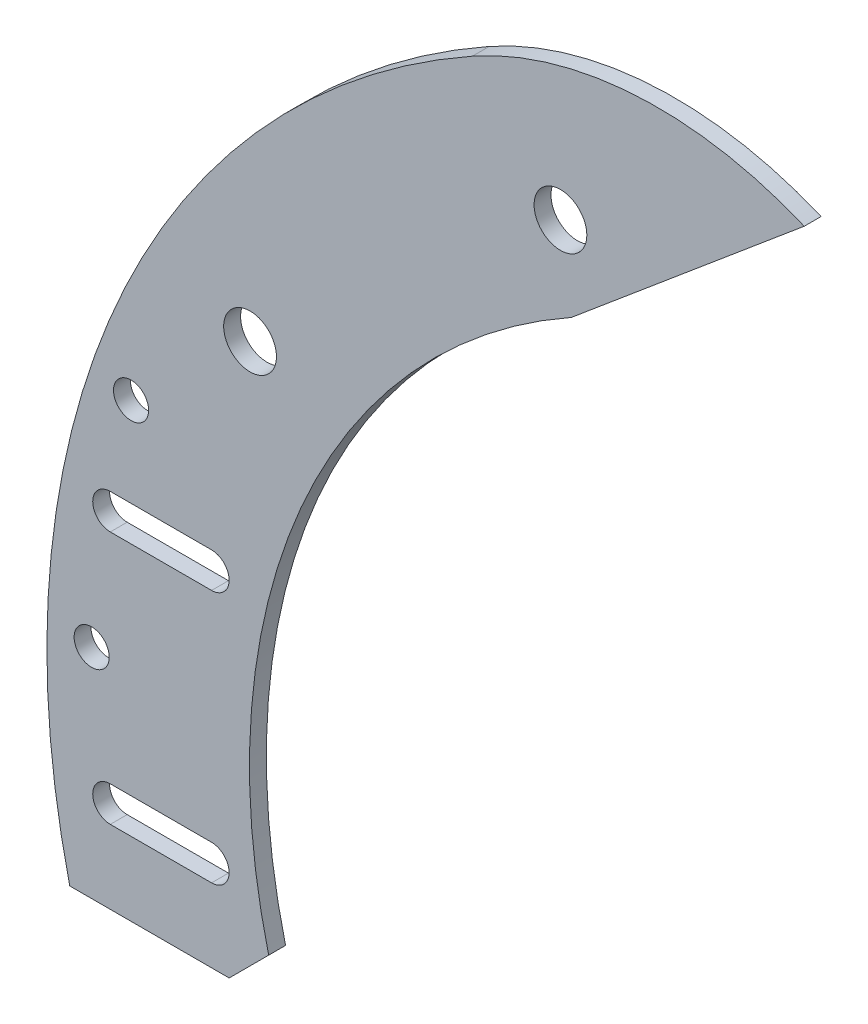
ISO-10303-21;
HEADER;
FILE_DESCRIPTION(('STEP AP214'),'2;1');
FILE_NAME('part.step','',(''),(''),'','','');
FILE_SCHEMA(('AUTOMOTIVE_DESIGN { 1 0 10303 214 1 1 1 1 }'));
ENDSEC;
DATA;
#1=APPLICATION_CONTEXT('core data for automotive mechanical design processes');
#2=APPLICATION_PROTOCOL_DEFINITION('international standard','automotive_design',2000,#1);
#3=PRODUCT_CONTEXT('',#1,'mechanical');
#4=PRODUCT('Part','Part','',(#3));
#5=PRODUCT_RELATED_PRODUCT_CATEGORY('part','',(#4));
#6=PRODUCT_DEFINITION_FORMATION('','',#4);
#7=PRODUCT_DEFINITION_CONTEXT('part definition',#1,'design');
#8=PRODUCT_DEFINITION('design','',#6,#7);
#9=PRODUCT_DEFINITION_SHAPE('','',#8);
#10=(LENGTH_UNIT() NAMED_UNIT(*) SI_UNIT(.MILLI.,.METRE.));
#11=(NAMED_UNIT(*) PLANE_ANGLE_UNIT() SI_UNIT($,.RADIAN.));
#12=(NAMED_UNIT(*) SI_UNIT($,.STERADIAN.) SOLID_ANGLE_UNIT());
#13=UNCERTAINTY_MEASURE_WITH_UNIT(LENGTH_MEASURE(1.E-05),#10,'distance_accuracy_value','');
#14=(GEOMETRIC_REPRESENTATION_CONTEXT(3) GLOBAL_UNCERTAINTY_ASSIGNED_CONTEXT((#13)) GLOBAL_UNIT_ASSIGNED_CONTEXT((#10,
#11,#12)) REPRESENTATION_CONTEXT('',''));
#15=CARTESIAN_POINT('',(0.,0.,0.));
#16=DIRECTION('',(0.,0.,1.));
#17=DIRECTION('',(1.,0.,0.));
#18=AXIS2_PLACEMENT_3D('',#15,#16,#17);
#19=CARTESIAN_POINT('',(-116.54874753084,-29.0822974566715,3.175));
#20=DIRECTION('',(-0.707106781186548,0.707106781186548,0.));
#21=DIRECTION('',(-0.707106781186548,-0.707106781186548,0.));
#22=AXIS2_PLACEMENT_3D('',#19,#20,#21);
#23=PLANE('',#22);
#24=DIRECTION('',(0.707106781186547,0.707106781186547,0.));
#25=VECTOR('',#24,1.);
#26=CARTESIAN_POINT('',(-116.54874753084,-29.0822974566715,0.));
#27=LINE('',#26,#25);
#28=CARTESIAN_POINT('',(-123.978950074169,-36.5125,0.));
#29=VERTEX_POINT('',#28);
#30=CARTESIAN_POINT('',(-116.54874753084,-29.0822974566715,0.));
#31=VERTEX_POINT('',#30);
#32=EDGE_CURVE('E190',#29,#31,#27,.T.);
#33=ORIENTED_EDGE('',*,*,#32,.T.);
#34=DIRECTION('',(0.,0.,-1.));
#35=VECTOR('',#34,1.);
#36=CARTESIAN_POINT('',(-116.54874753084,-29.0822974566715,3.175));
#37=LINE('',#36,#35);
#38=CARTESIAN_POINT('',(-116.54874753084,-29.0822974566715,3.175));
#39=VERTEX_POINT('',#38);
#40=EDGE_CURVE('E11',#39,#31,#37,.T.);
#41=ORIENTED_EDGE('',*,*,#40,.F.);
#42=DIRECTION('',(0.707106781186547,0.707106781186547,0.));
#43=VECTOR('',#42,1.);
#44=CARTESIAN_POINT('',(-116.54874753084,-29.0822974566715,3.175));
#45=LINE('',#44,#43);
#46=CARTESIAN_POINT('',(-123.978950074169,-36.5125,3.175));
#47=VERTEX_POINT('',#46);
#48=EDGE_CURVE('E191',#47,#39,#45,.T.);
#49=ORIENTED_EDGE('',*,*,#48,.F.);
#50=DIRECTION('',(0.,0.,-1.));
#51=VECTOR('',#50,1.);
#52=CARTESIAN_POINT('',(-123.978950074169,-36.5125,3.175));
#53=LINE('',#52,#51);
#54=EDGE_CURVE('E205',#47,#29,#53,.T.);
#55=ORIENTED_EDGE('',*,*,#54,.T.);
#56=EDGE_LOOP('',(#33,#41,#49,#55));
#57=FACE_BOUND('',#56,.T.);
#58=ADVANCED_FACE('F32',(#57),#23,.F.);
#59=CARTESIAN_POINT('',(-1.733804,-0.0635,3.175));
#60=DIRECTION('',(0.,0.,-1.));
#61=DIRECTION('',(-1.,0.,0.));
#62=AXIS2_PLACEMENT_3D('',#59,#60,#61);
#63=CYLINDRICAL_SURFACE('',#62,118.425342996427);
#64=CARTESIAN_POINT('',(-1.733804,-0.0635,0.));
#65=DIRECTION('',(0.,0.,-1.));
#66=DIRECTION('',(1.,0.,0.));
#67=AXIS2_PLACEMENT_3D('',#64,#65,#66);
#68=CIRCLE('',#67,118.425342996427);
#69=CARTESIAN_POINT('',(-59.6137000361257,103.253872685665,0.));
#70=VERTEX_POINT('',#69);
#71=EDGE_CURVE('E208',#31,#70,#68,.T.);
#72=ORIENTED_EDGE('',*,*,#71,.T.);
#73=DIRECTION('',(0.,0.,-1.));
#74=VECTOR('',#73,1.);
#75=CARTESIAN_POINT('',(-59.6137000361257,103.253872685665,3.175));
#76=LINE('',#75,#74);
#77=CARTESIAN_POINT('',(-59.6137000361257,103.253872685665,3.175));
#78=VERTEX_POINT('',#77);
#79=EDGE_CURVE('E39',#78,#70,#76,.T.);
#80=ORIENTED_EDGE('',*,*,#79,.F.);
#81=CARTESIAN_POINT('',(-1.733804,-0.0635,3.175));
#82=DIRECTION('',(0.,0.,-1.));
#83=DIRECTION('',(1.,0.,0.));
#84=AXIS2_PLACEMENT_3D('',#81,#82,#83);
#85=CIRCLE('',#84,118.425342996427);
#86=EDGE_CURVE('E194',#39,#78,#85,.T.);
#87=ORIENTED_EDGE('',*,*,#86,.F.);
#88=ORIENTED_EDGE('',*,*,#40,.T.);
#89=EDGE_LOOP('',(#72,#80,#87,#88));
#90=FACE_BOUND('',#89,.T.);
#91=ADVANCED_FACE('F254',(#90),#63,.F.);
#92=CARTESIAN_POINT('',(-59.6137000361257,103.253872685665,3.175));
#93=DIRECTION('',(-0.64278760968654,0.766044443118977,0.));
#94=DIRECTION('',(-0.766044443118977,-0.642787609686541,0.));
#95=AXIS2_PLACEMENT_3D('',#92,#93,#94);
#96=PLANE('',#95);
#97=DIRECTION('',(0.766044443118977,0.642787609686541,0.));
#98=VECTOR('',#97,1.);
#99=CARTESIAN_POINT('',(-59.6137000361257,103.253872685665,0.));
#100=LINE('',#99,#98);
#101=CARTESIAN_POINT('',(-15.8342601118761,139.989184579251,0.));
#102=VERTEX_POINT('',#101);
#103=EDGE_CURVE('E210',#70,#102,#100,.T.);
#104=ORIENTED_EDGE('',*,*,#103,.T.);
#105=DIRECTION('',(0.,0.,-1.));
#106=VECTOR('',#105,1.);
#107=CARTESIAN_POINT('',(-15.8342601118761,139.989184579251,3.175));
#108=LINE('',#107,#106);
#109=CARTESIAN_POINT('',(-15.8342601118761,139.989184579251,3.175));
#110=VERTEX_POINT('',#109);
#111=EDGE_CURVE('E225',#110,#102,#108,.T.);
#112=ORIENTED_EDGE('',*,*,#111,.F.);
#113=DIRECTION('',(0.766044443118977,0.642787609686541,0.));
#114=VECTOR('',#113,1.);
#115=CARTESIAN_POINT('',(-59.6137000361257,103.253872685665,3.175));
#116=LINE('',#115,#114);
#117=EDGE_CURVE('E197',#78,#110,#116,.T.);
#118=ORIENTED_EDGE('',*,*,#117,.F.);
#119=ORIENTED_EDGE('',*,*,#79,.T.);
#120=EDGE_LOOP('',(#104,#112,#118,#119));
#121=FACE_BOUND('',#120,.T.);
#122=ADVANCED_FACE('F232',(#121),#96,.F.);
#123=CARTESIAN_POINT('',(-43.4589721950456,74.4171927450066,3.175));
#124=DIRECTION('',(0.,0.,-1.));
#125=DIRECTION('',(-1.,0.,0.));
#126=AXIS2_PLACEMENT_3D('',#123,#124,#125);
#127=CYLINDRICAL_SURFACE('',#126,71.1534316163896);
#128=CARTESIAN_POINT('',(-43.4589721950456,74.4171927450066,0.));
#129=DIRECTION('',(0.,0.,1.));
#130=DIRECTION('',(-1.,0.,0.));
#131=AXIS2_PLACEMENT_3D('',#128,#129,#130);
#132=CIRCLE('',#131,71.1534316163896);
#133=CARTESIAN_POINT('',(-78.2349172788142,136.493311134601,0.));
#134=VERTEX_POINT('',#133);
#135=EDGE_CURVE('E212',#102,#134,#132,.T.);
#136=ORIENTED_EDGE('',*,*,#135,.T.);
#137=DIRECTION('',(0.,0.,-1.));
#138=VECTOR('',#137,1.);
#139=CARTESIAN_POINT('',(-78.2349172788142,136.493311134601,3.175));
#140=LINE('',#139,#138);
#141=CARTESIAN_POINT('',(-78.2349172788142,136.493311134601,3.175));
#142=VERTEX_POINT('',#141);
#143=EDGE_CURVE('E222',#142,#134,#140,.T.);
#144=ORIENTED_EDGE('',*,*,#143,.F.);
#145=CARTESIAN_POINT('',(-43.4589721950456,74.4171927450066,3.175));
#146=DIRECTION('',(0.,0.,1.));
#147=DIRECTION('',(-1.,0.,0.));
#148=AXIS2_PLACEMENT_3D('',#145,#146,#147);
#149=CIRCLE('',#148,71.1534316163896);
#150=EDGE_CURVE('E199',#110,#142,#149,.T.);
#151=ORIENTED_EDGE('',*,*,#150,.F.);
#152=ORIENTED_EDGE('',*,*,#111,.T.);
#153=EDGE_LOOP('',(#136,#144,#151,#152));
#154=FACE_BOUND('',#153,.T.);
#155=ADVANCED_FACE('F242',(#154),#127,.T.);
#156=CARTESIAN_POINT('',(-1.733804,-0.0635,3.175));
#157=DIRECTION('',(0.,0.,-1.));
#158=DIRECTION('',(-1.,0.,0.));
#159=AXIS2_PLACEMENT_3D('',#156,#157,#158);
#160=CYLINDRICAL_SURFACE('',#159,156.525342996427);
#161=CARTESIAN_POINT('',(-1.733804,-0.0635,0.));
#162=DIRECTION('',(0.,0.,1.));
#163=DIRECTION('',(1.,0.,0.));
#164=AXIS2_PLACEMENT_3D('',#161,#162,#163);
#165=CIRCLE('',#164,156.525342996427);
#166=CARTESIAN_POINT('',(-153.956185400204,-36.5125,0.));
#167=VERTEX_POINT('',#166);
#168=EDGE_CURVE('E214',#134,#167,#165,.T.);
#169=ORIENTED_EDGE('',*,*,#168,.T.);
#170=DIRECTION('',(0.,0.,-1.));
#171=VECTOR('',#170,1.);
#172=CARTESIAN_POINT('',(-153.956185400204,-36.5125,3.175));
#173=LINE('',#172,#171);
#174=CARTESIAN_POINT('',(-153.956185400204,-36.5125,3.175));
#175=VERTEX_POINT('',#174);
#176=EDGE_CURVE('E219',#175,#167,#173,.T.);
#177=ORIENTED_EDGE('',*,*,#176,.F.);
#178=CARTESIAN_POINT('',(-1.733804,-0.0635,3.175));
#179=DIRECTION('',(0.,0.,1.));
#180=DIRECTION('',(1.,0.,0.));
#181=AXIS2_PLACEMENT_3D('',#178,#179,#180);
#182=CIRCLE('',#181,156.525342996427);
#183=EDGE_CURVE('E201',#142,#175,#182,.T.);
#184=ORIENTED_EDGE('',*,*,#183,.F.);
#185=ORIENTED_EDGE('',*,*,#143,.T.);
#186=EDGE_LOOP('',(#169,#177,#184,#185));
#187=FACE_BOUND('',#186,.T.);
#188=ADVANCED_FACE('F246',(#187),#160,.T.);
#189=CARTESIAN_POINT('',(-153.956185400204,-36.5125,3.175));
#190=DIRECTION('',(0.,1.,0.));
#191=DIRECTION('',(0.,0.,1.));
#192=AXIS2_PLACEMENT_3D('',#189,#190,#191);
#193=PLANE('',#192);
#194=DIRECTION('',(1.,0.,0.));
#195=VECTOR('',#194,1.);
#196=CARTESIAN_POINT('',(-153.956185400204,-36.5125,0.));
#197=LINE('',#196,#195);
#198=EDGE_CURVE('E195',#167,#29,#197,.T.);
#199=ORIENTED_EDGE('',*,*,#198,.T.);
#200=ORIENTED_EDGE('',*,*,#54,.F.);
#201=DIRECTION('',(1.,0.,0.));
#202=VECTOR('',#201,1.);
#203=CARTESIAN_POINT('',(-153.956185400204,-36.5125,3.175));
#204=LINE('',#203,#202);
#205=EDGE_CURVE('E203',#175,#47,#204,.T.);
#206=ORIENTED_EDGE('',*,*,#205,.F.);
#207=ORIENTED_EDGE('',*,*,#176,.T.);
#208=EDGE_LOOP('',(#199,#200,#206,#207));
#209=FACE_BOUND('',#208,.T.);
#210=ADVANCED_FACE('F257',(#209),#193,.F.);
#211=CARTESIAN_POINT('',(-1.733804,-0.0635,3.175));
#212=DIRECTION('',(0.,0.,1.));
#213=DIRECTION('',(1.,0.,0.));
#214=AXIS2_PLACEMENT_3D('',#211,#212,#213);
#215=PLANE('',#214);
#216=CARTESIAN_POINT('',(-120.049591927874,69.1208106639492,3.175));
#217=DIRECTION('',(0.,0.,1.));
#218=DIRECTION('',(1.,0.,0.));
#219=AXIS2_PLACEMENT_3D('',#216,#217,#218);
#220=CIRCLE('',#219,4.96100099999999);
#221=CARTESIAN_POINT('',(-115.088590927874,69.1208106639492,3.175));
#222=VERTEX_POINT('',#221);
#223=EDGE_CURVE('E424',#222,#222,#220,.T.);
#224=ORIENTED_EDGE('',*,*,#223,.F.);
#225=EDGE_LOOP('',(#224));
#226=FACE_BOUND('',#225,.T.);
#227=CARTESIAN_POINT('',(-61.6770053622078,118.101226522064,3.175));
#228=DIRECTION('',(0.,0.,1.));
#229=DIRECTION('',(1.,0.,0.));
#230=AXIS2_PLACEMENT_3D('',#227,#228,#229);
#231=CIRCLE('',#230,4.96100099999999);
#232=CARTESIAN_POINT('',(-56.7160043622078,118.101226522064,3.175));
#233=VERTEX_POINT('',#232);
#234=EDGE_CURVE('E426',#233,#233,#231,.T.);
#235=ORIENTED_EDGE('',*,*,#234,.F.);
#236=EDGE_LOOP('',(#235));
#237=FACE_BOUND('',#236,.T.);
#238=CARTESIAN_POINT('',(-142.42715530255,48.3478669589237,3.175));
#239=DIRECTION('',(0.,0.,1.));
#240=DIRECTION('',(1.,0.,0.));
#241=AXIS2_PLACEMENT_3D('',#238,#239,#240);
#242=CIRCLE('',#241,3.30200000000001);
#243=CARTESIAN_POINT('',(-139.12515530255,48.3478669589237,3.175));
#244=VERTEX_POINT('',#243);
#245=EDGE_CURVE('E434',#244,#244,#242,.T.);
#246=ORIENTED_EDGE('',*,*,#245,.F.);
#247=EDGE_LOOP('',(#246));
#248=FACE_BOUND('',#247,.T.);
#249=CARTESIAN_POINT('',(-149.837364130512,4.445,3.175));
#250=DIRECTION('',(0.,0.,1.));
#251=DIRECTION('',(1.,0.,0.));
#252=AXIS2_PLACEMENT_3D('',#249,#250,#251);
#253=CIRCLE('',#252,3.30200000000001);
#254=CARTESIAN_POINT('',(-146.535364130512,4.445,3.175));
#255=VERTEX_POINT('',#254);
#256=EDGE_CURVE('E440',#255,#255,#253,.T.);
#257=ORIENTED_EDGE('',*,*,#256,.F.);
#258=EDGE_LOOP('',(#257));
#259=FACE_BOUND('',#258,.T.);
#260=CARTESIAN_POINT('',(-146.336185400204,-19.3675,3.175));
#261=DIRECTION('',(0.,0.,1.));
#262=DIRECTION('',(1.,0.,0.));
#263=AXIS2_PLACEMENT_3D('',#260,#261,#262);
#264=CIRCLE('',#263,3.302);
#265=CARTESIAN_POINT('',(-146.336185400204,-16.0655,3.175));
#266=VERTEX_POINT('',#265);
#267=CARTESIAN_POINT('',(-146.336185400204,-22.6695,3.175));
#268=VERTEX_POINT('',#267);
#269=EDGE_CURVE('E46',#266,#268,#264,.T.);
#270=ORIENTED_EDGE('',*,*,#269,.F.);
#271=DIRECTION('',(1.,0.,0.));
#272=VECTOR('',#271,1.);
#273=CARTESIAN_POINT('',(-146.336185400204,-16.0655,3.175));
#274=LINE('',#273,#272);
#275=CARTESIAN_POINT('',(-127.286185400204,-16.0655,3.175));
#276=VERTEX_POINT('',#275);
#277=EDGE_CURVE('E449',#266,#276,#274,.T.);
#278=ORIENTED_EDGE('',*,*,#277,.T.);
#279=CARTESIAN_POINT('',(-127.286185400204,-19.3675,3.175));
#280=DIRECTION('',(0.,0.,1.));
#281=DIRECTION('',(1.,0.,0.));
#282=AXIS2_PLACEMENT_3D('',#279,#280,#281);
#283=CIRCLE('',#282,3.302);
#284=CARTESIAN_POINT('',(-127.286185400204,-22.6695,3.175));
#285=VERTEX_POINT('',#284);
#286=EDGE_CURVE('E150',#285,#276,#283,.T.);
#287=ORIENTED_EDGE('',*,*,#286,.F.);
#288=DIRECTION('',(1.,0.,0.));
#289=VECTOR('',#288,1.);
#290=CARTESIAN_POINT('',(-146.336185400204,-22.6695,3.175));
#291=LINE('',#290,#289);
#292=EDGE_CURVE('E453',#268,#285,#291,.T.);
#293=ORIENTED_EDGE('',*,*,#292,.F.);
#294=EDGE_LOOP('',(#270,#278,#287,#293));
#295=FACE_BOUND('',#294,.T.);
#296=CARTESIAN_POINT('',(-146.336185400204,28.2575,3.175));
#297=DIRECTION('',(0.,0.,1.));
#298=DIRECTION('',(1.,0.,0.));
#299=AXIS2_PLACEMENT_3D('',#296,#297,#298);
#300=CIRCLE('',#299,3.302);
#301=CARTESIAN_POINT('',(-146.336185400204,31.5595,3.175));
#302=VERTEX_POINT('',#301);
#303=CARTESIAN_POINT('',(-146.336185400204,24.9555,3.175));
#304=VERTEX_POINT('',#303);
#305=EDGE_CURVE('E170',#302,#304,#300,.T.);
#306=ORIENTED_EDGE('',*,*,#305,.F.);
#307=DIRECTION('',(1.,0.,0.));
#308=VECTOR('',#307,1.);
#309=CARTESIAN_POINT('',(-146.336185400204,31.5595,3.175));
#310=LINE('',#309,#308);
#311=CARTESIAN_POINT('',(-127.286185400204,31.5595,3.175));
#312=VERTEX_POINT('',#311);
#313=EDGE_CURVE('E178',#302,#312,#310,.T.);
#314=ORIENTED_EDGE('',*,*,#313,.T.);
#315=CARTESIAN_POINT('',(-127.286185400204,28.2575,3.175));
#316=DIRECTION('',(0.,0.,1.));
#317=DIRECTION('',(1.,0.,0.));
#318=AXIS2_PLACEMENT_3D('',#315,#316,#317);
#319=CIRCLE('',#318,3.302);
#320=CARTESIAN_POINT('',(-127.286185400204,24.9555,3.175));
#321=VERTEX_POINT('',#320);
#322=EDGE_CURVE('E175',#321,#312,#319,.T.);
#323=ORIENTED_EDGE('',*,*,#322,.F.);
#324=DIRECTION('',(1.,0.,0.));
#325=VECTOR('',#324,1.);
#326=CARTESIAN_POINT('',(-146.336185400204,24.9555,3.175));
#327=LINE('',#326,#325);
#328=EDGE_CURVE('E172',#304,#321,#327,.T.);
#329=ORIENTED_EDGE('',*,*,#328,.F.);
#330=EDGE_LOOP('',(#306,#314,#323,#329));
#331=FACE_BOUND('',#330,.T.);
#332=ORIENTED_EDGE('',*,*,#48,.T.);
#333=ORIENTED_EDGE('',*,*,#86,.T.);
#334=ORIENTED_EDGE('',*,*,#117,.T.);
#335=ORIENTED_EDGE('',*,*,#150,.T.);
#336=ORIENTED_EDGE('',*,*,#183,.T.);
#337=ORIENTED_EDGE('',*,*,#205,.T.);
#338=EDGE_LOOP('',(#332,#333,#334,#335,#336,#337));
#339=FACE_BOUND('',#338,.T.);
#340=ADVANCED_FACE('F250',(#226,#237,#248,#259,#295,#331,#339),#215,.T.);
#341=CARTESIAN_POINT('',(-1.733804,-0.0635,0.));
#342=DIRECTION('',(0.,0.,1.));
#343=DIRECTION('',(1.,0.,0.));
#344=AXIS2_PLACEMENT_3D('',#341,#342,#343);
#345=PLANE('',#344);
#346=CARTESIAN_POINT('',(-120.049591927874,69.1208106639492,0.));
#347=DIRECTION('',(0.,0.,1.));
#348=DIRECTION('',(1.,0.,0.));
#349=AXIS2_PLACEMENT_3D('',#346,#347,#348);
#350=CIRCLE('',#349,4.96100100000001);
#351=CARTESIAN_POINT('',(-115.088590927874,69.1208106639492,0.));
#352=VERTEX_POINT('',#351);
#353=EDGE_CURVE('E421',#352,#352,#350,.T.);
#354=ORIENTED_EDGE('',*,*,#353,.T.);
#355=EDGE_LOOP('',(#354));
#356=FACE_BOUND('',#355,.T.);
#357=CARTESIAN_POINT('',(-61.6770053622078,118.101226522064,0.));
#358=DIRECTION('',(0.,0.,1.));
#359=DIRECTION('',(1.,0.,0.));
#360=AXIS2_PLACEMENT_3D('',#357,#358,#359);
#361=CIRCLE('',#360,4.961001);
#362=CARTESIAN_POINT('',(-56.7160043622078,118.101226522064,0.));
#363=VERTEX_POINT('',#362);
#364=EDGE_CURVE('E431',#363,#363,#361,.T.);
#365=ORIENTED_EDGE('',*,*,#364,.T.);
#366=EDGE_LOOP('',(#365));
#367=FACE_BOUND('',#366,.T.);
#368=CARTESIAN_POINT('',(-142.42715530255,48.3478669589237,0.));
#369=DIRECTION('',(0.,0.,1.));
#370=DIRECTION('',(1.,0.,0.));
#371=AXIS2_PLACEMENT_3D('',#368,#369,#370);
#372=CIRCLE('',#371,3.30200000000001);
#373=CARTESIAN_POINT('',(-139.12515530255,48.3478669589237,0.));
#374=VERTEX_POINT('',#373);
#375=EDGE_CURVE('E437',#374,#374,#372,.F.);
#376=ORIENTED_EDGE('',*,*,#375,.F.);
#377=EDGE_LOOP('',(#376));
#378=FACE_BOUND('',#377,.T.);
#379=CARTESIAN_POINT('',(-149.837364130512,4.445,0.));
#380=DIRECTION('',(0.,0.,1.));
#381=DIRECTION('',(1.,0.,0.));
#382=AXIS2_PLACEMENT_3D('',#379,#380,#381);
#383=CIRCLE('',#382,3.30200000000001);
#384=CARTESIAN_POINT('',(-146.535364130512,4.445,0.));
#385=VERTEX_POINT('',#384);
#386=EDGE_CURVE('E443',#385,#385,#383,.F.);
#387=ORIENTED_EDGE('',*,*,#386,.F.);
#388=EDGE_LOOP('',(#387));
#389=FACE_BOUND('',#388,.T.);
#390=DIRECTION('',(-1.,0.,0.));
#391=VECTOR('',#390,1.);
#392=CARTESIAN_POINT('',(-146.336185400204,-16.0655,0.));
#393=LINE('',#392,#391);
#394=CARTESIAN_POINT('',(-127.286185400204,-16.0655,0.));
#395=VERTEX_POINT('',#394);
#396=CARTESIAN_POINT('',(-146.336185400204,-16.0655,0.));
#397=VERTEX_POINT('',#396);
#398=EDGE_CURVE('E133',#395,#397,#393,.T.);
#399=ORIENTED_EDGE('',*,*,#398,.T.);
#400=CARTESIAN_POINT('',(-146.336185400204,-19.3675,0.));
#401=DIRECTION('',(0.,0.,1.));
#402=DIRECTION('',(1.,0.,0.));
#403=AXIS2_PLACEMENT_3D('',#400,#401,#402);
#404=CIRCLE('',#403,3.302);
#405=CARTESIAN_POINT('',(-146.336185400204,-22.6695,0.));
#406=VERTEX_POINT('',#405);
#407=EDGE_CURVE('E144',#406,#397,#404,.F.);
#408=ORIENTED_EDGE('',*,*,#407,.F.);
#409=DIRECTION('',(-1.,0.,0.));
#410=VECTOR('',#409,1.);
#411=CARTESIAN_POINT('',(-146.336185400204,-22.6695,0.));
#412=LINE('',#411,#410);
#413=CARTESIAN_POINT('',(-127.286185400204,-22.6695,0.));
#414=VERTEX_POINT('',#413);
#415=EDGE_CURVE('E155',#414,#406,#412,.T.);
#416=ORIENTED_EDGE('',*,*,#415,.F.);
#417=CARTESIAN_POINT('',(-127.286185400204,-19.3675,0.));
#418=DIRECTION('',(0.,0.,1.));
#419=DIRECTION('',(1.,0.,0.));
#420=AXIS2_PLACEMENT_3D('',#417,#418,#419);
#421=CIRCLE('',#420,3.302);
#422=EDGE_CURVE('E143',#395,#414,#421,.F.);
#423=ORIENTED_EDGE('',*,*,#422,.F.);
#424=EDGE_LOOP('',(#399,#408,#416,#423));
#425=FACE_BOUND('',#424,.T.);
#426=DIRECTION('',(-1.,0.,0.));
#427=VECTOR('',#426,1.);
#428=CARTESIAN_POINT('',(-146.336185400204,31.5595,0.));
#429=LINE('',#428,#427);
#430=CARTESIAN_POINT('',(-127.286185400204,31.5595,0.));
#431=VERTEX_POINT('',#430);
#432=CARTESIAN_POINT('',(-146.336185400204,31.5595,0.));
#433=VERTEX_POINT('',#432);
#434=EDGE_CURVE('E163',#431,#433,#429,.T.);
#435=ORIENTED_EDGE('',*,*,#434,.T.);
#436=CARTESIAN_POINT('',(-146.336185400204,28.2575,0.));
#437=DIRECTION('',(0.,0.,1.));
#438=DIRECTION('',(1.,0.,0.));
#439=AXIS2_PLACEMENT_3D('',#436,#437,#438);
#440=CIRCLE('',#439,3.302);
#441=CARTESIAN_POINT('',(-146.336185400204,24.9555,0.));
#442=VERTEX_POINT('',#441);
#443=EDGE_CURVE('E167',#442,#433,#440,.F.);
#444=ORIENTED_EDGE('',*,*,#443,.F.);
#445=DIRECTION('',(-1.,0.,0.));
#446=VECTOR('',#445,1.);
#447=CARTESIAN_POINT('',(-146.336185400204,24.9555,0.));
#448=LINE('',#447,#446);
#449=CARTESIAN_POINT('',(-127.286185400204,24.9555,0.));
#450=VERTEX_POINT('',#449);
#451=EDGE_CURVE('E169',#450,#442,#448,.T.);
#452=ORIENTED_EDGE('',*,*,#451,.F.);
#453=CARTESIAN_POINT('',(-127.286185400204,28.2575,0.));
#454=DIRECTION('',(0.,0.,1.));
#455=DIRECTION('',(1.,0.,0.));
#456=AXIS2_PLACEMENT_3D('',#453,#454,#455);
#457=CIRCLE('',#456,3.302);
#458=EDGE_CURVE('E160',#431,#450,#457,.F.);
#459=ORIENTED_EDGE('',*,*,#458,.F.);
#460=EDGE_LOOP('',(#435,#444,#452,#459));
#461=FACE_BOUND('',#460,.T.);
#462=ORIENTED_EDGE('',*,*,#32,.F.);
#463=ORIENTED_EDGE('',*,*,#198,.F.);
#464=ORIENTED_EDGE('',*,*,#168,.F.);
#465=ORIENTED_EDGE('',*,*,#135,.F.);
#466=ORIENTED_EDGE('',*,*,#103,.F.);
#467=ORIENTED_EDGE('',*,*,#71,.F.);
#468=EDGE_LOOP('',(#462,#463,#464,#465,#466,#467));
#469=FACE_BOUND('',#468,.T.);
#470=ADVANCED_FACE('F153',(#356,#367,#378,#389,#425,#461,#469),#345,.F.);
#471=CARTESIAN_POINT('',(-146.336185400204,28.2575,-26.4903856521569));
#472=DIRECTION('',(0.,0.,1.));
#473=DIRECTION('',(1.,0.,0.));
#474=AXIS2_PLACEMENT_3D('',#471,#472,#473);
#475=CYLINDRICAL_SURFACE('',#474,3.302);
#476=ORIENTED_EDGE('',*,*,#443,.T.);
#477=DIRECTION('',(0.,0.,1.));
#478=VECTOR('',#477,1.);
#479=CARTESIAN_POINT('',(-146.336185400204,31.5595,-26.4903856521569));
#480=LINE('',#479,#478);
#481=EDGE_CURVE('E164',#433,#302,#480,.T.);
#482=ORIENTED_EDGE('',*,*,#481,.T.);
#483=ORIENTED_EDGE('',*,*,#305,.T.);
#484=DIRECTION('',(0.,0.,1.));
#485=VECTOR('',#484,1.);
#486=CARTESIAN_POINT('',(-146.336185400204,24.9555,-26.4903856521569));
#487=LINE('',#486,#485);
#488=EDGE_CURVE('E181',#442,#304,#487,.T.);
#489=ORIENTED_EDGE('',*,*,#488,.F.);
#490=EDGE_LOOP('',(#476,#482,#483,#489));
#491=FACE_BOUND('',#490,.T.);
#492=ADVANCED_FACE('F297',(#491),#475,.F.);
#493=CARTESIAN_POINT('',(-146.336185400204,31.5595,-26.4903856521569));
#494=DIRECTION('',(0.,-1.,0.));
#495=DIRECTION('',(0.,0.,-1.));
#496=AXIS2_PLACEMENT_3D('',#493,#494,#495);
#497=PLANE('',#496);
#498=DIRECTION('',(0.,0.,1.));
#499=VECTOR('',#498,1.);
#500=CARTESIAN_POINT('',(-127.286185400204,31.5595,-26.4903856521569));
#501=LINE('',#500,#499);
#502=EDGE_CURVE('E183',#431,#312,#501,.T.);
#503=ORIENTED_EDGE('',*,*,#502,.T.);
#504=ORIENTED_EDGE('',*,*,#313,.F.);
#505=ORIENTED_EDGE('',*,*,#481,.F.);
#506=ORIENTED_EDGE('',*,*,#434,.F.);
#507=EDGE_LOOP('',(#503,#504,#505,#506));
#508=FACE_BOUND('',#507,.T.);
#509=ADVANCED_FACE('F302',(#508),#497,.T.);
#510=CARTESIAN_POINT('',(-127.286185400204,28.2575,-26.4903856521569));
#511=DIRECTION('',(0.,0.,1.));
#512=DIRECTION('',(1.,0.,0.));
#513=AXIS2_PLACEMENT_3D('',#510,#511,#512);
#514=CYLINDRICAL_SURFACE('',#513,3.302);
#515=ORIENTED_EDGE('',*,*,#458,.T.);
#516=DIRECTION('',(0.,0.,1.));
#517=VECTOR('',#516,1.);
#518=CARTESIAN_POINT('',(-127.286185400204,24.9555,-26.4903856521569));
#519=LINE('',#518,#517);
#520=EDGE_CURVE('E185',#450,#321,#519,.T.);
#521=ORIENTED_EDGE('',*,*,#520,.T.);
#522=ORIENTED_EDGE('',*,*,#322,.T.);
#523=ORIENTED_EDGE('',*,*,#502,.F.);
#524=EDGE_LOOP('',(#515,#521,#522,#523));
#525=FACE_BOUND('',#524,.T.);
#526=ADVANCED_FACE('F314',(#525),#514,.F.);
#527=CARTESIAN_POINT('',(-146.336185400204,24.9555,-26.4903856521569));
#528=DIRECTION('',(0.,-1.,0.));
#529=DIRECTION('',(0.,0.,-1.));
#530=AXIS2_PLACEMENT_3D('',#527,#528,#529);
#531=PLANE('',#530);
#532=ORIENTED_EDGE('',*,*,#451,.T.);
#533=ORIENTED_EDGE('',*,*,#488,.T.);
#534=ORIENTED_EDGE('',*,*,#328,.T.);
#535=ORIENTED_EDGE('',*,*,#520,.F.);
#536=EDGE_LOOP('',(#532,#533,#534,#535));
#537=FACE_BOUND('',#536,.T.);
#538=ADVANCED_FACE('F324',(#537),#531,.F.);
#539=CARTESIAN_POINT('',(-146.336185400204,-19.3675,-26.4903856521569));
#540=DIRECTION('',(0.,0.,1.));
#541=DIRECTION('',(1.,0.,0.));
#542=AXIS2_PLACEMENT_3D('',#539,#540,#541);
#543=CYLINDRICAL_SURFACE('',#542,3.302);
#544=ORIENTED_EDGE('',*,*,#407,.T.);
#545=DIRECTION('',(0.,0.,1.));
#546=VECTOR('',#545,1.);
#547=CARTESIAN_POINT('',(-146.336185400204,-16.0655,-26.4903856521569));
#548=LINE('',#547,#546);
#549=EDGE_CURVE('E139',#397,#266,#548,.T.);
#550=ORIENTED_EDGE('',*,*,#549,.T.);
#551=ORIENTED_EDGE('',*,*,#269,.T.);
#552=DIRECTION('',(0.,0.,1.));
#553=VECTOR('',#552,1.);
#554=CARTESIAN_POINT('',(-146.336185400204,-22.6695,-26.4903856521569));
#555=LINE('',#554,#553);
#556=EDGE_CURVE('E447',#406,#268,#555,.T.);
#557=ORIENTED_EDGE('',*,*,#556,.F.);
#558=EDGE_LOOP('',(#544,#550,#551,#557));
#559=FACE_BOUND('',#558,.T.);
#560=ADVANCED_FACE('F334',(#559),#543,.F.);
#561=CARTESIAN_POINT('',(-146.336185400204,-16.0655,-26.4903856521569));
#562=DIRECTION('',(0.,-1.,0.));
#563=DIRECTION('',(1.,0.,0.));
#564=AXIS2_PLACEMENT_3D('',#561,#562,#563);
#565=PLANE('',#564);
#566=DIRECTION('',(0.,0.,1.));
#567=VECTOR('',#566,1.);
#568=CARTESIAN_POINT('',(-127.286185400204,-16.0655,-26.4903856521569));
#569=LINE('',#568,#567);
#570=EDGE_CURVE('E137',#395,#276,#569,.T.);
#571=ORIENTED_EDGE('',*,*,#570,.T.);
#572=ORIENTED_EDGE('',*,*,#277,.F.);
#573=ORIENTED_EDGE('',*,*,#549,.F.);
#574=ORIENTED_EDGE('',*,*,#398,.F.);
#575=EDGE_LOOP('',(#571,#572,#573,#574));
#576=FACE_BOUND('',#575,.T.);
#577=ADVANCED_FACE('F135',(#576),#565,.T.);
#578=CARTESIAN_POINT('',(-127.286185400204,-19.3675,-26.4903856521569));
#579=DIRECTION('',(0.,0.,1.));
#580=DIRECTION('',(1.,0.,0.));
#581=AXIS2_PLACEMENT_3D('',#578,#579,#580);
#582=CYLINDRICAL_SURFACE('',#581,3.302);
#583=ORIENTED_EDGE('',*,*,#422,.T.);
#584=DIRECTION('',(0.,0.,1.));
#585=VECTOR('',#584,1.);
#586=CARTESIAN_POINT('',(-127.286185400204,-22.6695,-26.4903856521569));
#587=LINE('',#586,#585);
#588=EDGE_CURVE('E54',#414,#285,#587,.T.);
#589=ORIENTED_EDGE('',*,*,#588,.T.);
#590=ORIENTED_EDGE('',*,*,#286,.T.);
#591=ORIENTED_EDGE('',*,*,#570,.F.);
#592=EDGE_LOOP('',(#583,#589,#590,#591));
#593=FACE_BOUND('',#592,.T.);
#594=ADVANCED_FACE('F147',(#593),#582,.F.);
#595=CARTESIAN_POINT('',(-146.336185400204,-22.6695,-26.4903856521569));
#596=DIRECTION('',(0.,-1.,0.));
#597=DIRECTION('',(1.,0.,0.));
#598=AXIS2_PLACEMENT_3D('',#595,#596,#597);
#599=PLANE('',#598);
#600=ORIENTED_EDGE('',*,*,#415,.T.);
#601=ORIENTED_EDGE('',*,*,#556,.T.);
#602=ORIENTED_EDGE('',*,*,#292,.T.);
#603=ORIENTED_EDGE('',*,*,#588,.F.);
#604=EDGE_LOOP('',(#600,#601,#602,#603));
#605=FACE_BOUND('',#604,.T.);
#606=ADVANCED_FACE('F360',(#605),#599,.F.);
#607=CARTESIAN_POINT('',(-149.837364130512,4.445,-9.33946636591194));
#608=DIRECTION('',(0.,0.,1.));
#609=DIRECTION('',(1.,0.,0.));
#610=AXIS2_PLACEMENT_3D('',#607,#608,#609);
#611=CYLINDRICAL_SURFACE('',#610,3.30200000000001);
#612=ORIENTED_EDGE('',*,*,#386,.T.);
#613=EDGE_LOOP('',(#612));
#614=FACE_BOUND('',#613,.T.);
#615=ORIENTED_EDGE('',*,*,#256,.T.);
#616=EDGE_LOOP('',(#615));
#617=FACE_BOUND('',#616,.T.);
#618=ADVANCED_FACE('F369',(#614,#617),#611,.F.);
#619=CARTESIAN_POINT('',(-142.42715530255,48.3478669589237,-9.33946636591194));
#620=DIRECTION('',(0.,0.,1.));
#621=DIRECTION('',(1.,0.,0.));
#622=AXIS2_PLACEMENT_3D('',#619,#620,#621);
#623=CYLINDRICAL_SURFACE('',#622,3.30200000000001);
#624=ORIENTED_EDGE('',*,*,#375,.T.);
#625=EDGE_LOOP('',(#624));
#626=FACE_BOUND('',#625,.T.);
#627=ORIENTED_EDGE('',*,*,#245,.T.);
#628=EDGE_LOOP('',(#627));
#629=FACE_BOUND('',#628,.T.);
#630=ADVANCED_FACE('F378',(#626,#629),#623,.F.);
#631=CARTESIAN_POINT('',(-61.6770053622078,118.101226522064,3.175));
#632=DIRECTION('',(0.,0.,1.));
#633=DIRECTION('',(1.,0.,0.));
#634=AXIS2_PLACEMENT_3D('',#631,#632,#633);
#635=CYLINDRICAL_SURFACE('',#634,4.96100099999999);
#636=ORIENTED_EDGE('',*,*,#364,.F.);
#637=EDGE_LOOP('',(#636));
#638=FACE_BOUND('',#637,.T.);
#639=ORIENTED_EDGE('',*,*,#234,.T.);
#640=EDGE_LOOP('',(#639));
#641=FACE_BOUND('',#640,.T.);
#642=ADVANCED_FACE('F387',(#638,#641),#635,.F.);
#643=CARTESIAN_POINT('',(-120.049591927874,69.1208106639492,3.175));
#644=DIRECTION('',(0.,0.,1.));
#645=DIRECTION('',(1.,0.,0.));
#646=AXIS2_PLACEMENT_3D('',#643,#644,#645);
#647=CYLINDRICAL_SURFACE('',#646,4.961001);
#648=ORIENTED_EDGE('',*,*,#353,.F.);
#649=EDGE_LOOP('',(#648));
#650=FACE_BOUND('',#649,.T.);
#651=ORIENTED_EDGE('',*,*,#223,.T.);
#652=EDGE_LOOP('',(#651));
#653=FACE_BOUND('',#652,.T.);
#654=ADVANCED_FACE('F404',(#650,#653),#647,.F.);
#655=CLOSED_SHELL('',(#58,#91,#122,#155,#188,#210,#340,#470,#492,#509,#526,#538,#560,#577,#594,
#606,#618,#630,#642,#654));
#656=MANIFOLD_SOLID_BREP('B2',#655);
#657=ADVANCED_BREP_SHAPE_REPRESENTATION('',(#18,#656),#14);
#658=SHAPE_DEFINITION_REPRESENTATION(#9,#657);
ENDSEC;
END-ISO-10303-21;
